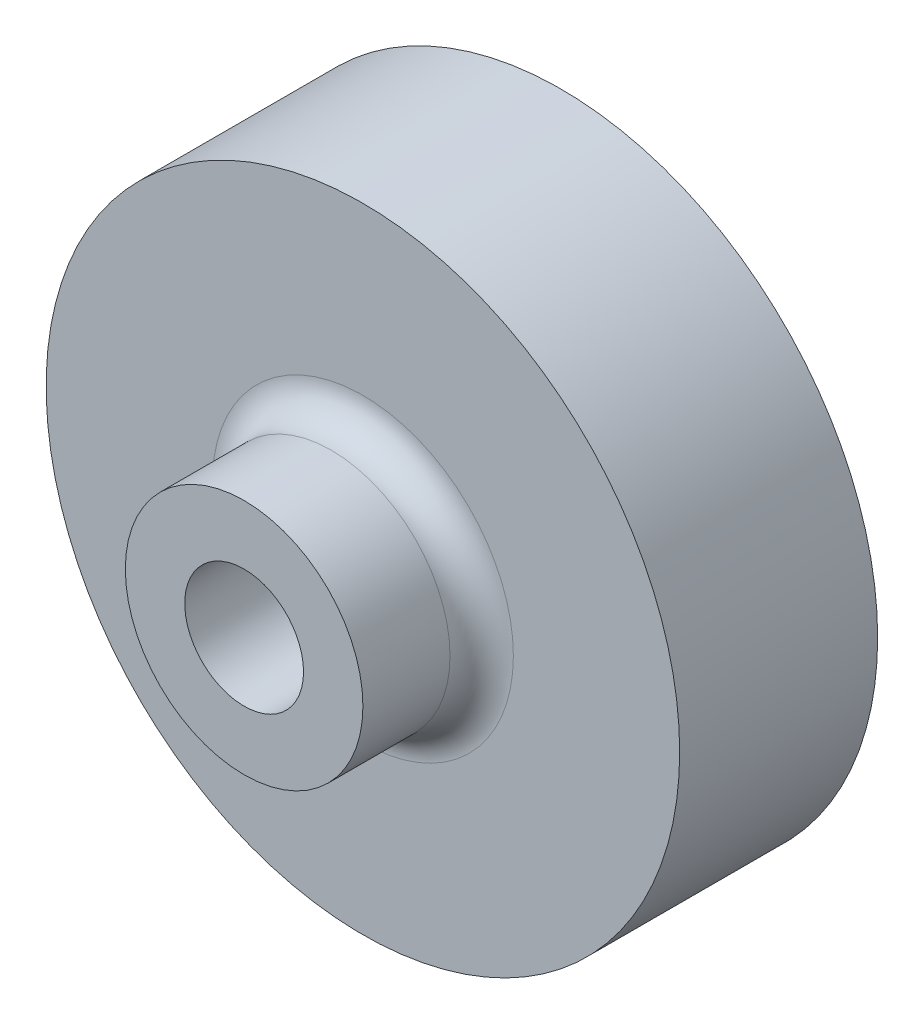
ISO-10303-21;
HEADER;
FILE_DESCRIPTION(('STEP AP214'),'2;1');
FILE_NAME('part.step','',(''),(''),'','','');
FILE_SCHEMA(('AUTOMOTIVE_DESIGN { 1 0 10303 214 1 1 1 1 }'));
ENDSEC;
DATA;
#1=APPLICATION_CONTEXT('core data for automotive mechanical design processes');
#2=APPLICATION_PROTOCOL_DEFINITION('international standard','automotive_design',2000,#1);
#3=PRODUCT_CONTEXT('',#1,'mechanical');
#4=PRODUCT('Part','Part','',(#3));
#5=PRODUCT_RELATED_PRODUCT_CATEGORY('part','',(#4));
#6=PRODUCT_DEFINITION_FORMATION('','',#4);
#7=PRODUCT_DEFINITION_CONTEXT('part definition',#1,'design');
#8=PRODUCT_DEFINITION('design','',#6,#7);
#9=PRODUCT_DEFINITION_SHAPE('','',#8);
#10=(LENGTH_UNIT() NAMED_UNIT(*) SI_UNIT(.MILLI.,.METRE.));
#11=(NAMED_UNIT(*) PLANE_ANGLE_UNIT() SI_UNIT($,.RADIAN.));
#12=(NAMED_UNIT(*) SI_UNIT($,.STERADIAN.) SOLID_ANGLE_UNIT());
#13=UNCERTAINTY_MEASURE_WITH_UNIT(LENGTH_MEASURE(1.E-05),#10,'distance_accuracy_value','');
#14=(GEOMETRIC_REPRESENTATION_CONTEXT(3) GLOBAL_UNCERTAINTY_ASSIGNED_CONTEXT((#13)) GLOBAL_UNIT_ASSIGNED_CONTEXT((#10,
#11,#12)) REPRESENTATION_CONTEXT('',''));
#15=CARTESIAN_POINT('',(0.,0.,0.));
#16=DIRECTION('',(0.,0.,1.));
#17=DIRECTION('',(1.,0.,0.));
#18=AXIS2_PLACEMENT_3D('',#15,#16,#17);
#19=CARTESIAN_POINT('',(0.,0.,15.875));
#20=DIRECTION('',(0.,0.,-1.));
#21=DIRECTION('',(-1.,0.,0.));
#22=AXIS2_PLACEMENT_3D('',#19,#20,#21);
#23=CYLINDRICAL_SURFACE('',#22,25.4);
#24=CARTESIAN_POINT('',(0.,0.,15.875));
#25=DIRECTION('',(0.,0.,1.));
#26=DIRECTION('',(1.,0.,0.));
#27=AXIS2_PLACEMENT_3D('',#24,#25,#26);
#28=CIRCLE('',#27,25.4);
#29=CARTESIAN_POINT('',(25.4,0.,15.875));
#30=VERTEX_POINT('',#29);
#31=EDGE_CURVE('E104',#30,#30,#28,.T.);
#32=ORIENTED_EDGE('',*,*,#31,.F.);
#33=EDGE_LOOP('',(#32));
#34=FACE_BOUND('',#33,.T.);
#35=CARTESIAN_POINT('',(0.,0.,0.));
#36=DIRECTION('',(0.,0.,1.));
#37=DIRECTION('',(1.,0.,0.));
#38=AXIS2_PLACEMENT_3D('',#35,#36,#37);
#39=CIRCLE('',#38,25.4);
#40=CARTESIAN_POINT('',(25.4,0.,0.));
#41=VERTEX_POINT('',#40);
#42=EDGE_CURVE('E102',#41,#41,#39,.T.);
#43=ORIENTED_EDGE('',*,*,#42,.T.);
#44=EDGE_LOOP('',(#43));
#45=FACE_BOUND('',#44,.T.);
#46=ADVANCED_FACE('F33',(#34,#45),#23,.T.);
#47=CARTESIAN_POINT('',(0.,0.,15.875));
#48=DIRECTION('',(0.,0.,1.));
#49=DIRECTION('',(1.,0.,0.));
#50=AXIS2_PLACEMENT_3D('',#47,#48,#49);
#51=PLANE('',#50);
#52=CARTESIAN_POINT('',(0.,0.,15.875));
#53=DIRECTION('',(0.,0.,1.));
#54=DIRECTION('',(1.,0.,0.));
#55=AXIS2_PLACEMENT_3D('',#52,#53,#54);
#56=CIRCLE('',#55,12.065);
#57=CARTESIAN_POINT('',(12.065,0.,15.875));
#58=VERTEX_POINT('',#57);
#59=EDGE_CURVE('E11',#58,#58,#56,.F.);
#60=ORIENTED_EDGE('',*,*,#59,.T.);
#61=EDGE_LOOP('',(#60));
#62=FACE_BOUND('',#61,.T.);
#63=ORIENTED_EDGE('',*,*,#31,.T.);
#64=EDGE_LOOP('',(#63));
#65=FACE_BOUND('',#64,.T.);
#66=ADVANCED_FACE('F126',(#62,#65),#51,.T.);
#67=CARTESIAN_POINT('',(0.,0.,0.));
#68=DIRECTION('',(0.,0.,1.));
#69=DIRECTION('',(1.,0.,0.));
#70=AXIS2_PLACEMENT_3D('',#67,#68,#69);
#71=PLANE('',#70);
#72=DIRECTION('',(0.,-1.,0.));
#73=VECTOR('',#72,1.);
#74=CARTESIAN_POINT('',(1.27,0.,0.));
#75=LINE('',#74,#73);
#76=CARTESIAN_POINT('',(1.27,4.5900442535993,0.));
#77=VERTEX_POINT('',#76);
#78=CARTESIAN_POINT('',(1.27,-4.59004425359931,0.));
#79=VERTEX_POINT('',#78);
#80=EDGE_CURVE('E47',#77,#79,#75,.T.);
#81=ORIENTED_EDGE('',*,*,#80,.T.);
#82=CARTESIAN_POINT('',(0.,0.,0.));
#83=DIRECTION('',(0.,0.,1.));
#84=DIRECTION('',(1.,0.,0.));
#85=AXIS2_PLACEMENT_3D('',#82,#83,#84);
#86=CIRCLE('',#85,4.7625);
#87=EDGE_CURVE('E94',#79,#77,#86,.T.);
#88=ORIENTED_EDGE('',*,*,#87,.T.);
#89=EDGE_LOOP('',(#81,#88));
#90=FACE_BOUND('',#89,.T.);
#91=DIRECTION('',(0.,1.,0.));
#92=VECTOR('',#91,1.);
#93=CARTESIAN_POINT('',(-1.27,4.7625,0.));
#94=LINE('',#93,#92);
#95=CARTESIAN_POINT('',(-1.27,-4.5900442535993,0.));
#96=VERTEX_POINT('',#95);
#97=CARTESIAN_POINT('',(-1.27,4.59004425359931,0.));
#98=VERTEX_POINT('',#97);
#99=EDGE_CURVE('E54',#96,#98,#94,.T.);
#100=ORIENTED_EDGE('',*,*,#99,.T.);
#101=EDGE_CURVE('E86',#98,#96,#86,.T.);
#102=ORIENTED_EDGE('',*,*,#101,.T.);
#103=EDGE_LOOP('',(#100,#102));
#104=FACE_BOUND('',#103,.T.);
#105=ORIENTED_EDGE('',*,*,#42,.F.);
#106=EDGE_LOOP('',(#105));
#107=FACE_BOUND('',#106,.T.);
#108=ADVANCED_FACE('F91',(#90,#104,#107),#71,.F.);
#109=CARTESIAN_POINT('',(0.,0.,25.4));
#110=DIRECTION('',(0.,0.,1.));
#111=DIRECTION('',(1.,0.,0.));
#112=AXIS2_PLACEMENT_3D('',#109,#110,#111);
#113=PLANE('',#112);
#114=CARTESIAN_POINT('',(0.,0.,25.4));
#115=DIRECTION('',(0.,0.,1.));
#116=DIRECTION('',(1.,0.,0.));
#117=AXIS2_PLACEMENT_3D('',#114,#115,#116);
#118=CIRCLE('',#117,9.525);
#119=CARTESIAN_POINT('',(9.525,0.,25.4));
#120=VERTEX_POINT('',#119);
#121=EDGE_CURVE('E97',#120,#120,#118,.T.);
#122=ORIENTED_EDGE('',*,*,#121,.T.);
#123=EDGE_LOOP('',(#122));
#124=FACE_BOUND('',#123,.T.);
#125=CARTESIAN_POINT('',(0.,0.,25.4));
#126=DIRECTION('',(0.,0.,1.));
#127=DIRECTION('',(1.,0.,0.));
#128=AXIS2_PLACEMENT_3D('',#125,#126,#127);
#129=CIRCLE('',#128,4.7625);
#130=CARTESIAN_POINT('',(4.7625,0.,25.4));
#131=VERTEX_POINT('',#130);
#132=EDGE_CURVE('E93',#131,#131,#129,.T.);
#133=ORIENTED_EDGE('',*,*,#132,.F.);
#134=EDGE_LOOP('',(#133));
#135=FACE_BOUND('',#134,.T.);
#136=ADVANCED_FACE('F137',(#124,#135),#113,.T.);
#137=CARTESIAN_POINT('',(0.,0.,25.4));
#138=DIRECTION('',(0.,0.,-1.));
#139=DIRECTION('',(-1.,0.,0.));
#140=AXIS2_PLACEMENT_3D('',#137,#138,#139);
#141=CYLINDRICAL_SURFACE('',#140,9.525);
#142=CARTESIAN_POINT('',(0.,0.,18.415));
#143=DIRECTION('',(0.,0.,1.));
#144=DIRECTION('',(1.,0.,0.));
#145=AXIS2_PLACEMENT_3D('',#142,#143,#144);
#146=CIRCLE('',#145,9.525);
#147=CARTESIAN_POINT('',(9.525,0.,18.415));
#148=VERTEX_POINT('',#147);
#149=EDGE_CURVE('E41',#148,#148,#146,.T.);
#150=ORIENTED_EDGE('',*,*,#149,.T.);
#151=EDGE_LOOP('',(#150));
#152=FACE_BOUND('',#151,.T.);
#153=ORIENTED_EDGE('',*,*,#121,.F.);
#154=EDGE_LOOP('',(#153));
#155=FACE_BOUND('',#154,.T.);
#156=ADVANCED_FACE('F114',(#152,#155),#141,.T.);
#157=CARTESIAN_POINT('',(0.,0.,25.4));
#158=DIRECTION('',(0.,0.,-1.));
#159=DIRECTION('',(-1.,0.,0.));
#160=AXIS2_PLACEMENT_3D('',#157,#158,#159);
#161=CYLINDRICAL_SURFACE('',#160,4.7625);
#162=DIRECTION('',(0.,0.,-1.));
#163=VECTOR('',#162,1.);
#164=CARTESIAN_POINT('',(1.27,4.5900442535993,25.4));
#165=LINE('',#164,#163);
#166=CARTESIAN_POINT('',(1.27,4.5900442535993,3.175));
#167=VERTEX_POINT('',#166);
#168=EDGE_CURVE('E109',#77,#167,#165,.F.);
#169=ORIENTED_EDGE('',*,*,#168,.F.);
#170=ORIENTED_EDGE('',*,*,#87,.F.);
#171=DIRECTION('',(0.,0.,-1.));
#172=VECTOR('',#171,1.);
#173=CARTESIAN_POINT('',(1.27,-4.5900442535993,25.4));
#174=LINE('',#173,#172);
#175=CARTESIAN_POINT('',(1.27,-4.5900442535993,3.175));
#176=VERTEX_POINT('',#175);
#177=EDGE_CURVE('E89',#176,#79,#174,.T.);
#178=ORIENTED_EDGE('',*,*,#177,.F.);
#179=CARTESIAN_POINT('',(0.,0.,3.175));
#180=DIRECTION('',(0.,0.,1.));
#181=DIRECTION('',(1.,0.,0.));
#182=AXIS2_PLACEMENT_3D('',#179,#180,#181);
#183=CIRCLE('',#182,4.7625);
#184=CARTESIAN_POINT('',(-1.27,-4.5900442535993,3.175));
#185=VERTEX_POINT('',#184);
#186=EDGE_CURVE('E88',#185,#176,#183,.T.);
#187=ORIENTED_EDGE('',*,*,#186,.F.);
#188=DIRECTION('',(0.,0.,-1.));
#189=VECTOR('',#188,1.);
#190=CARTESIAN_POINT('',(-1.27,-4.5900442535993,25.4));
#191=LINE('',#190,#189);
#192=EDGE_CURVE('E76',#96,#185,#191,.F.);
#193=ORIENTED_EDGE('',*,*,#192,.F.);
#194=ORIENTED_EDGE('',*,*,#101,.F.);
#195=DIRECTION('',(0.,0.,-1.));
#196=VECTOR('',#195,1.);
#197=CARTESIAN_POINT('',(-1.27,4.5900442535993,25.4));
#198=LINE('',#197,#196);
#199=CARTESIAN_POINT('',(-1.27,4.5900442535993,3.175));
#200=VERTEX_POINT('',#199);
#201=EDGE_CURVE('E79',#200,#98,#198,.T.);
#202=ORIENTED_EDGE('',*,*,#201,.F.);
#203=EDGE_CURVE('E105',#167,#200,#183,.T.);
#204=ORIENTED_EDGE('',*,*,#203,.F.);
#205=EDGE_LOOP('',(#169,#170,#178,#187,#193,#194,#202,#204));
#206=FACE_BOUND('',#205,.T.);
#207=ORIENTED_EDGE('',*,*,#132,.T.);
#208=EDGE_LOOP('',(#207));
#209=FACE_BOUND('',#208,.T.);
#210=ADVANCED_FACE('F84',(#206,#209),#161,.F.);
#211=CARTESIAN_POINT('',(0.,0.,3.175));
#212=DIRECTION('',(0.,0.,1.));
#213=DIRECTION('',(1.,0.,0.));
#214=AXIS2_PLACEMENT_3D('',#211,#212,#213);
#215=PLANE('',#214);
#216=DIRECTION('',(0.,-1.,0.));
#217=VECTOR('',#216,1.);
#218=CARTESIAN_POINT('',(1.27,4.7625,3.175));
#219=LINE('',#218,#217);
#220=EDGE_CURVE('E99',#167,#176,#219,.T.);
#221=ORIENTED_EDGE('',*,*,#220,.F.);
#222=ORIENTED_EDGE('',*,*,#203,.T.);
#223=DIRECTION('',(0.,1.,0.));
#224=VECTOR('',#223,1.);
#225=CARTESIAN_POINT('',(-1.27,-4.7625,3.175));
#226=LINE('',#225,#224);
#227=EDGE_CURVE('E156',#185,#200,#226,.T.);
#228=ORIENTED_EDGE('',*,*,#227,.F.);
#229=ORIENTED_EDGE('',*,*,#186,.T.);
#230=EDGE_LOOP('',(#221,#222,#228,#229));
#231=FACE_BOUND('',#230,.T.);
#232=ADVANCED_FACE('F145',(#231),#215,.T.);
#233=CARTESIAN_POINT('',(1.27,0.,3.175));
#234=DIRECTION('',(1.,0.,0.));
#235=DIRECTION('',(0.,0.,-1.));
#236=AXIS2_PLACEMENT_3D('',#233,#234,#235);
#237=PLANE('',#236);
#238=ORIENTED_EDGE('',*,*,#220,.T.);
#239=ORIENTED_EDGE('',*,*,#177,.T.);
#240=ORIENTED_EDGE('',*,*,#80,.F.);
#241=ORIENTED_EDGE('',*,*,#168,.T.);
#242=EDGE_LOOP('',(#238,#239,#240,#241));
#243=FACE_BOUND('',#242,.T.);
#244=ADVANCED_FACE('F122',(#243),#237,.T.);
#245=CARTESIAN_POINT('',(-1.27,4.7625,3.175));
#246=DIRECTION('',(-1.,0.,0.));
#247=DIRECTION('',(0.,0.,1.));
#248=AXIS2_PLACEMENT_3D('',#245,#246,#247);
#249=PLANE('',#248);
#250=ORIENTED_EDGE('',*,*,#227,.T.);
#251=ORIENTED_EDGE('',*,*,#201,.T.);
#252=ORIENTED_EDGE('',*,*,#99,.F.);
#253=ORIENTED_EDGE('',*,*,#192,.T.);
#254=EDGE_LOOP('',(#250,#251,#252,#253));
#255=FACE_BOUND('',#254,.T.);
#256=ADVANCED_FACE('F75',(#255),#249,.T.);
#257=CARTESIAN_POINT('',(0.,0.,18.415));
#258=DIRECTION('',(0.,0.,1.));
#259=DIRECTION('',(1.,0.,0.));
#260=AXIS2_PLACEMENT_3D('',#257,#258,#259);
#261=TOROIDAL_SURFACE('',#260,12.065,2.54);
#262=ORIENTED_EDGE('',*,*,#59,.F.);
#263=EDGE_LOOP('',(#262));
#264=FACE_BOUND('',#263,.T.);
#265=ORIENTED_EDGE('',*,*,#149,.F.);
#266=EDGE_LOOP('',(#265));
#267=FACE_BOUND('',#266,.T.);
#268=ADVANCED_FACE('F35',(#264,#267),#261,.F.);
#269=CLOSED_SHELL('',(#46,#66,#108,#136,#156,#210,#232,#244,#256,#268));
#270=MANIFOLD_SOLID_BREP('B2',#269);
#271=ADVANCED_BREP_SHAPE_REPRESENTATION('',(#18,#270),#14);
#272=SHAPE_DEFINITION_REPRESENTATION(#9,#271);
ENDSEC;
END-ISO-10303-21;
